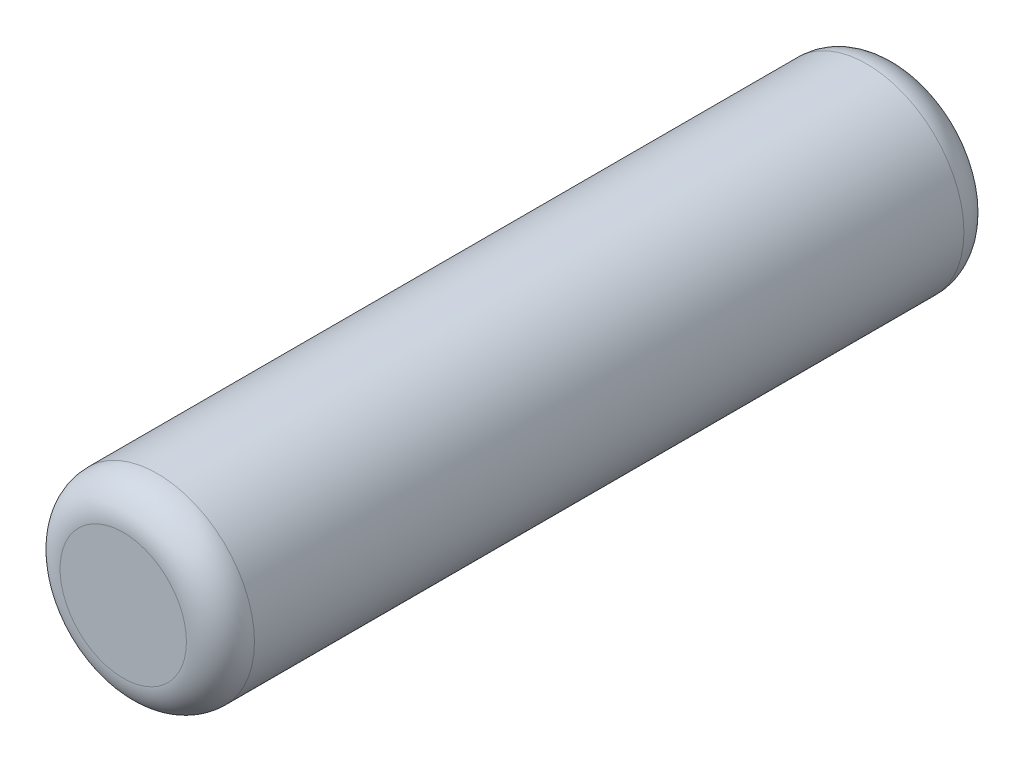
ISO-10303-21;
HEADER;
FILE_DESCRIPTION(('STEP AP214'),'2;1');
FILE_NAME('part.step','',(''),(''),'','','');
FILE_SCHEMA(('AUTOMOTIVE_DESIGN { 1 0 10303 214 1 1 1 1 }'));
ENDSEC;
DATA;
#1=APPLICATION_CONTEXT('core data for automotive mechanical design processes');
#2=APPLICATION_PROTOCOL_DEFINITION('international standard','automotive_design',2000,#1);
#3=PRODUCT_CONTEXT('',#1,'mechanical');
#4=PRODUCT('Part','Part','',(#3));
#5=PRODUCT_RELATED_PRODUCT_CATEGORY('part','',(#4));
#6=PRODUCT_DEFINITION_FORMATION('','',#4);
#7=PRODUCT_DEFINITION_CONTEXT('part definition',#1,'design');
#8=PRODUCT_DEFINITION('design','',#6,#7);
#9=PRODUCT_DEFINITION_SHAPE('','',#8);
#10=(LENGTH_UNIT() NAMED_UNIT(*) SI_UNIT(.MILLI.,.METRE.));
#11=(NAMED_UNIT(*) PLANE_ANGLE_UNIT() SI_UNIT($,.RADIAN.));
#12=(NAMED_UNIT(*) SI_UNIT($,.STERADIAN.) SOLID_ANGLE_UNIT());
#13=UNCERTAINTY_MEASURE_WITH_UNIT(LENGTH_MEASURE(1.E-05),#10,'distance_accuracy_value','');
#14=(GEOMETRIC_REPRESENTATION_CONTEXT(3) GLOBAL_UNCERTAINTY_ASSIGNED_CONTEXT((#13)) GLOBAL_UNIT_ASSIGNED_CONTEXT((#10,
#11,#12)) REPRESENTATION_CONTEXT('',''));
#15=CARTESIAN_POINT('',(0.,0.,0.));
#16=DIRECTION('',(0.,0.,1.));
#17=DIRECTION('',(1.,0.,0.));
#18=AXIS2_PLACEMENT_3D('',#15,#16,#17);
#19=CARTESIAN_POINT('',(0.,0.,4.));
#20=DIRECTION('',(0.,0.,-1.));
#21=DIRECTION('',(-1.,0.,0.));
#22=AXIS2_PLACEMENT_3D('',#19,#20,#21);
#23=CYLINDRICAL_SURFACE('',#22,1.);
#24=CARTESIAN_POINT('',(0.,0.,-3.65));
#25=DIRECTION('',(0.,0.,1.));
#26=DIRECTION('',(1.,0.,0.));
#27=AXIS2_PLACEMENT_3D('',#24,#25,#26);
#28=CIRCLE('',#27,1.);
#29=CARTESIAN_POINT('',(1.,0.,-3.65));
#30=VERTEX_POINT('',#29);
#31=EDGE_CURVE('E42',#30,#30,#28,.T.);
#32=ORIENTED_EDGE('',*,*,#31,.T.);
#33=EDGE_LOOP('',(#32));
#34=FACE_BOUND('',#33,.T.);
#35=CARTESIAN_POINT('',(0.,0.,3.65));
#36=DIRECTION('',(0.,0.,1.));
#37=DIRECTION('',(1.,0.,0.));
#38=AXIS2_PLACEMENT_3D('',#35,#36,#37);
#39=CIRCLE('',#38,1.);
#40=CARTESIAN_POINT('',(1.,0.,3.65));
#41=VERTEX_POINT('',#40);
#42=EDGE_CURVE('E46',#41,#41,#39,.F.);
#43=ORIENTED_EDGE('',*,*,#42,.T.);
#44=EDGE_LOOP('',(#43));
#45=FACE_BOUND('',#44,.T.);
#46=ADVANCED_FACE('F31',(#34,#45),#23,.T.);
#47=CARTESIAN_POINT('',(0.,0.,4.));
#48=DIRECTION('',(0.,0.,1.));
#49=DIRECTION('',(1.,0.,0.));
#50=AXIS2_PLACEMENT_3D('',#47,#48,#49);
#51=PLANE('',#50);
#52=CARTESIAN_POINT('',(0.,0.,4.));
#53=DIRECTION('',(0.,0.,1.));
#54=DIRECTION('',(1.,0.,0.));
#55=AXIS2_PLACEMENT_3D('',#52,#53,#54);
#56=CIRCLE('',#55,0.65);
#57=CARTESIAN_POINT('',(0.65,0.,4.));
#58=VERTEX_POINT('',#57);
#59=EDGE_CURVE('E10',#58,#58,#56,.T.);
#60=ORIENTED_EDGE('',*,*,#59,.T.);
#61=EDGE_LOOP('',(#60));
#62=FACE_BOUND('',#61,.T.);
#63=ADVANCED_FACE('F62',(#62),#51,.T.);
#64=CARTESIAN_POINT('',(0.,0.,-4.));
#65=DIRECTION('',(0.,0.,1.));
#66=DIRECTION('',(1.,0.,0.));
#67=AXIS2_PLACEMENT_3D('',#64,#65,#66);
#68=PLANE('',#67);
#69=CARTESIAN_POINT('',(0.,0.,-4.));
#70=DIRECTION('',(0.,0.,1.));
#71=DIRECTION('',(1.,0.,0.));
#72=AXIS2_PLACEMENT_3D('',#69,#70,#71);
#73=CIRCLE('',#72,0.65);
#74=CARTESIAN_POINT('',(0.65,0.,-4.));
#75=VERTEX_POINT('',#74);
#76=EDGE_CURVE('E38',#75,#75,#73,.F.);
#77=ORIENTED_EDGE('',*,*,#76,.T.);
#78=EDGE_LOOP('',(#77));
#79=FACE_BOUND('',#78,.T.);
#80=ADVANCED_FACE('F59',(#79),#68,.F.);
#81=CARTESIAN_POINT('',(0.,0.,-3.65));
#82=DIRECTION('',(0.,0.,1.));
#83=DIRECTION('',(1.,0.,0.));
#84=AXIS2_PLACEMENT_3D('',#81,#82,#83);
#85=TOROIDAL_SURFACE('',#84,0.65,0.35);
#86=ORIENTED_EDGE('',*,*,#76,.F.);
#87=EDGE_LOOP('',(#86));
#88=FACE_BOUND('',#87,.T.);
#89=ORIENTED_EDGE('',*,*,#31,.F.);
#90=EDGE_LOOP('',(#89));
#91=FACE_BOUND('',#90,.T.);
#92=ADVANCED_FACE('F55',(#88,#91),#85,.T.);
#93=CARTESIAN_POINT('',(0.,0.,3.65));
#94=DIRECTION('',(0.,0.,1.));
#95=DIRECTION('',(1.,0.,0.));
#96=AXIS2_PLACEMENT_3D('',#93,#94,#95);
#97=TOROIDAL_SURFACE('',#96,0.65,0.35);
#98=ORIENTED_EDGE('',*,*,#42,.F.);
#99=EDGE_LOOP('',(#98));
#100=FACE_BOUND('',#99,.T.);
#101=ORIENTED_EDGE('',*,*,#59,.F.);
#102=EDGE_LOOP('',(#101));
#103=FACE_BOUND('',#102,.T.);
#104=ADVANCED_FACE('F33',(#100,#103),#97,.T.);
#105=CLOSED_SHELL('',(#46,#63,#80,#92,#104));
#106=MANIFOLD_SOLID_BREP('B2',#105);
#107=ADVANCED_BREP_SHAPE_REPRESENTATION('',(#18,#106),#14);
#108=SHAPE_DEFINITION_REPRESENTATION(#9,#107);
ENDSEC;
END-ISO-10303-21;
